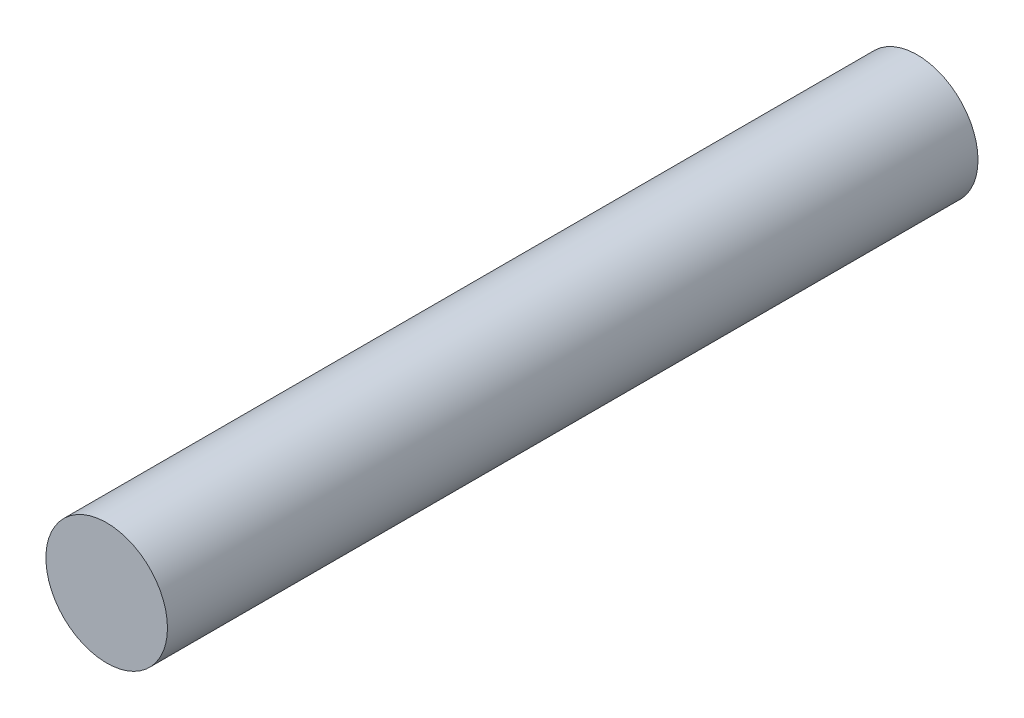
ISO-10303-21;
HEADER;
FILE_DESCRIPTION(('STEP AP214'),'2;1');
FILE_NAME('part.step','',(''),(''),'','','');
FILE_SCHEMA(('AUTOMOTIVE_DESIGN { 1 0 10303 214 1 1 1 1 }'));
ENDSEC;
DATA;
#1=APPLICATION_CONTEXT('core data for automotive mechanical design processes');
#2=APPLICATION_PROTOCOL_DEFINITION('international standard','automotive_design',2000,#1);
#3=PRODUCT_CONTEXT('',#1,'mechanical');
#4=PRODUCT('Part','Part','',(#3));
#5=PRODUCT_RELATED_PRODUCT_CATEGORY('part','',(#4));
#6=PRODUCT_DEFINITION_FORMATION('','',#4);
#7=PRODUCT_DEFINITION_CONTEXT('part definition',#1,'design');
#8=PRODUCT_DEFINITION('design','',#6,#7);
#9=PRODUCT_DEFINITION_SHAPE('','',#8);
#10=(LENGTH_UNIT() NAMED_UNIT(*) SI_UNIT(.MILLI.,.METRE.));
#11=(NAMED_UNIT(*) PLANE_ANGLE_UNIT() SI_UNIT($,.RADIAN.));
#12=(NAMED_UNIT(*) SI_UNIT($,.STERADIAN.) SOLID_ANGLE_UNIT());
#13=UNCERTAINTY_MEASURE_WITH_UNIT(LENGTH_MEASURE(1.E-05),#10,'distance_accuracy_value','');
#14=(GEOMETRIC_REPRESENTATION_CONTEXT(3) GLOBAL_UNCERTAINTY_ASSIGNED_CONTEXT((#13)) GLOBAL_UNIT_ASSIGNED_CONTEXT((#10,
#11,#12)) REPRESENTATION_CONTEXT('',''));
#15=CARTESIAN_POINT('',(0.,0.,0.));
#16=DIRECTION('',(0.,0.,1.));
#17=DIRECTION('',(1.,0.,0.));
#18=AXIS2_PLACEMENT_3D('',#15,#16,#17);
#19=CARTESIAN_POINT('',(0.,0.,0.));
#20=DIRECTION('',(0.,0.,1.));
#21=DIRECTION('',(1.,0.,0.));
#22=AXIS2_PLACEMENT_3D('',#19,#20,#21);
#23=CYLINDRICAL_SURFACE('',#22,1.5);
#24=CARTESIAN_POINT('',(0.,0.,0.));
#25=DIRECTION('',(0.,0.,1.));
#26=DIRECTION('',(1.,0.,0.));
#27=AXIS2_PLACEMENT_3D('',#24,#25,#26);
#28=CIRCLE('',#27,1.5);
#29=CARTESIAN_POINT('',(1.5,0.,0.));
#30=VERTEX_POINT('',#29);
#31=EDGE_CURVE('E10',#30,#30,#28,.T.);
#32=ORIENTED_EDGE('',*,*,#31,.T.);
#33=EDGE_LOOP('',(#32));
#34=FACE_BOUND('',#33,.T.);
#35=CARTESIAN_POINT('',(0.,0.,20.));
#36=DIRECTION('',(0.,0.,1.));
#37=DIRECTION('',(1.,0.,0.));
#38=AXIS2_PLACEMENT_3D('',#35,#36,#37);
#39=CIRCLE('',#38,1.5);
#40=CARTESIAN_POINT('',(1.5,0.,20.));
#41=VERTEX_POINT('',#40);
#42=EDGE_CURVE('E37',#41,#41,#39,.T.);
#43=ORIENTED_EDGE('',*,*,#42,.F.);
#44=EDGE_LOOP('',(#43));
#45=FACE_BOUND('',#44,.T.);
#46=ADVANCED_FACE('F31',(#34,#45),#23,.T.);
#47=CARTESIAN_POINT('',(1.5,0.,0.));
#48=DIRECTION('',(0.,0.,-1.));
#49=DIRECTION('',(-1.,0.,0.));
#50=AXIS2_PLACEMENT_3D('',#47,#48,#49);
#51=PLANE('',#50);
#52=ORIENTED_EDGE('',*,*,#31,.F.);
#53=EDGE_LOOP('',(#52));
#54=FACE_BOUND('',#53,.T.);
#55=ADVANCED_FACE('F46',(#54),#51,.T.);
#56=CARTESIAN_POINT('',(0.,0.,20.));
#57=DIRECTION('',(0.,0.,1.));
#58=DIRECTION('',(1.,0.,0.));
#59=AXIS2_PLACEMENT_3D('',#56,#57,#58);
#60=PLANE('',#59);
#61=ORIENTED_EDGE('',*,*,#42,.T.);
#62=EDGE_LOOP('',(#61));
#63=FACE_BOUND('',#62,.T.);
#64=ADVANCED_FACE('F43',(#63),#60,.T.);
#65=CLOSED_SHELL('',(#46,#55,#64));
#66=MANIFOLD_SOLID_BREP('B2',#65);
#67=ADVANCED_BREP_SHAPE_REPRESENTATION('',(#18,#66),#14);
#68=SHAPE_DEFINITION_REPRESENTATION(#9,#67);
ENDSEC;
END-ISO-10303-21;
